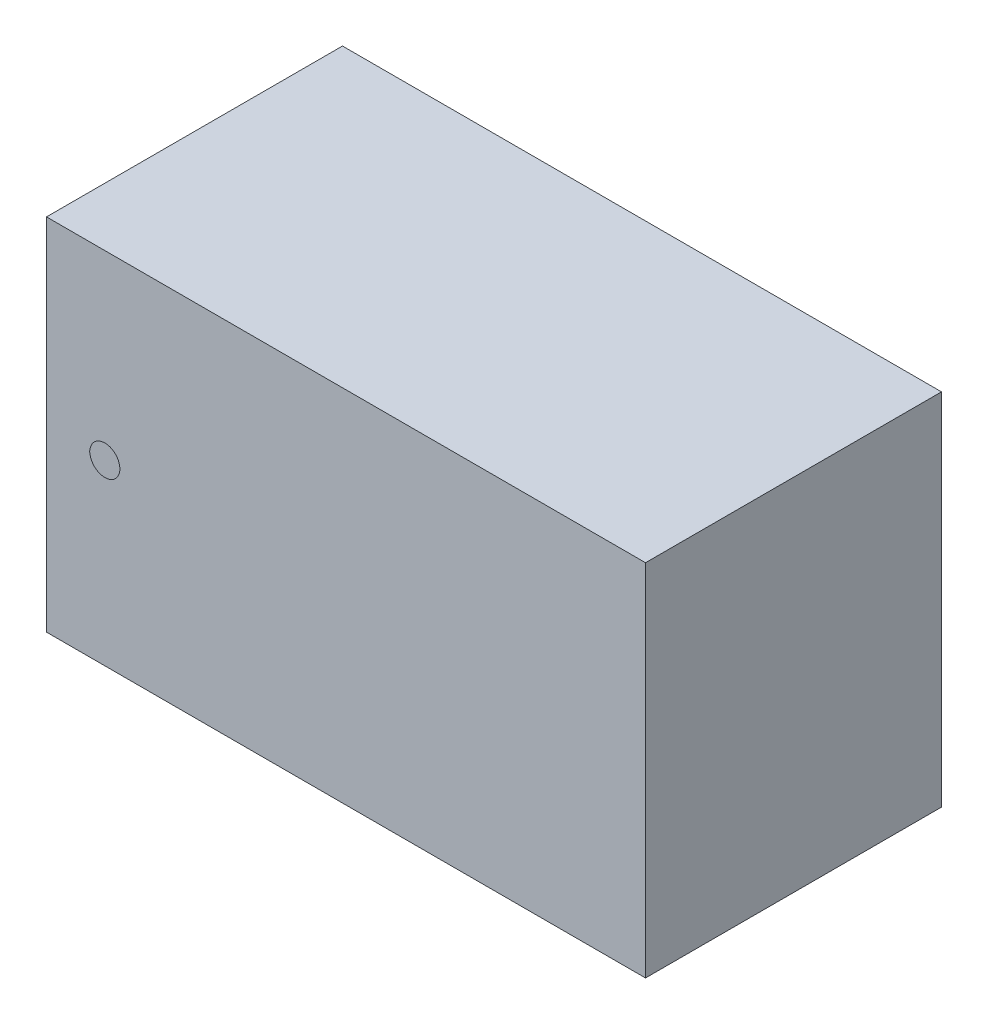
ISO-10303-21;
HEADER;
FILE_DESCRIPTION(('STEP AP214'),'2;1');
FILE_NAME('part.step','',(''),(''),'','','');
FILE_SCHEMA(('AUTOMOTIVE_DESIGN { 1 0 10303 214 1 1 1 1 }'));
ENDSEC;
DATA;
#1=APPLICATION_CONTEXT('core data for automotive mechanical design processes');
#2=APPLICATION_PROTOCOL_DEFINITION('international standard','automotive_design',2000,#1);
#3=PRODUCT_CONTEXT('',#1,'mechanical');
#4=PRODUCT('Part','Part','',(#3));
#5=PRODUCT_RELATED_PRODUCT_CATEGORY('part','',(#4));
#6=PRODUCT_DEFINITION_FORMATION('','',#4);
#7=PRODUCT_DEFINITION_CONTEXT('part definition',#1,'design');
#8=PRODUCT_DEFINITION('design','',#6,#7);
#9=PRODUCT_DEFINITION_SHAPE('','',#8);
#10=(LENGTH_UNIT() NAMED_UNIT(*) SI_UNIT(.MILLI.,.METRE.));
#11=(NAMED_UNIT(*) PLANE_ANGLE_UNIT() SI_UNIT($,.RADIAN.));
#12=(NAMED_UNIT(*) SI_UNIT($,.STERADIAN.) SOLID_ANGLE_UNIT());
#13=UNCERTAINTY_MEASURE_WITH_UNIT(LENGTH_MEASURE(1.E-05),#10,'distance_accuracy_value','');
#14=(GEOMETRIC_REPRESENTATION_CONTEXT(3) GLOBAL_UNCERTAINTY_ASSIGNED_CONTEXT((#13)) GLOBAL_UNIT_ASSIGNED_CONTEXT((#10,
#11,#12)) REPRESENTATION_CONTEXT('',''));
#15=CARTESIAN_POINT('',(0.,0.,0.));
#16=DIRECTION('',(0.,0.,1.));
#17=DIRECTION('',(1.,0.,0.));
#18=AXIS2_PLACEMENT_3D('',#15,#16,#17);
#19=CARTESIAN_POINT('',(-0.406,0.,0.508));
#20=DIRECTION('',(0.,0.,1.));
#21=DIRECTION('',(0.,1.,0.));
#22=AXIS2_PLACEMENT_3D('',#19,#20,#21);
#23=PLANE('',#22);
#24=CARTESIAN_POINT('',(-0.406,0.,0.508));
#25=DIRECTION('',(0.,0.,-1.));
#26=DIRECTION('',(1.,0.,0.));
#27=AXIS2_PLACEMENT_3D('',#24,#25,#26);
#28=CIRCLE('',#27,0.0254);
#29=CARTESIAN_POINT('',(-0.432,0.,0.511));
#30=VERTEX_POINT('',#29);
#31=CARTESIAN_POINT('',(-0.3806,0.,0.508));
#32=VERTEX_POINT('',#31);
#33=EDGE_CURVE('P0_E11',#30,#32,#28,.T.);
#34=ORIENTED_EDGE('',*,*,#33,.T.);
#35=CARTESIAN_POINT('',(-0.406,0.,0.508));
#36=DIRECTION('',(0.,0.,-1.));
#37=DIRECTION('',(1.,0.,0.));
#38=AXIS2_PLACEMENT_3D('',#35,#36,#37);
#39=CIRCLE('',#38,0.0254);
#40=EDGE_CURVE('P0_E22',#32,#30,#39,.T.);
#41=ORIENTED_EDGE('',*,*,#40,.T.);
#42=EDGE_LOOP('',(#34,#41));
#43=FACE_BOUND('',#42,.T.);
#44=ADVANCED_FACE('P0_F17',(#43),#23,.F.);
#45=OPEN_SHELL('',(#44));
#46=SHELL_BASED_SURFACE_MODEL('P0_B1',(#45));
#47=CARTESIAN_POINT('',(-0.406,0.,0.511));
#48=DIRECTION('',(0.,0.,1.));
#49=DIRECTION('',(0.,1.,0.));
#50=AXIS2_PLACEMENT_3D('',#47,#48,#49);
#51=PLANE('',#50);
#52=CARTESIAN_POINT('',(-0.406,0.,0.511));
#53=DIRECTION('',(0.,0.,1.));
#54=DIRECTION('',(1.,0.,0.));
#55=AXIS2_PLACEMENT_3D('',#52,#53,#54);
#56=CIRCLE('',#55,0.0254);
#57=CARTESIAN_POINT('',(-0.432,0.,0.511));
#58=VERTEX_POINT('',#57);
#59=CARTESIAN_POINT('',(-0.3806,0.,0.511));
#60=VERTEX_POINT('',#59);
#61=EDGE_CURVE('P1_E11',#58,#60,#56,.T.);
#62=ORIENTED_EDGE('',*,*,#61,.T.);
#63=CARTESIAN_POINT('',(-0.406,0.,0.511));
#64=DIRECTION('',(0.,0.,1.));
#65=DIRECTION('',(1.,0.,0.));
#66=AXIS2_PLACEMENT_3D('',#63,#64,#65);
#67=CIRCLE('',#66,0.0254);
#68=EDGE_CURVE('P1_E22',#60,#58,#67,.T.);
#69=ORIENTED_EDGE('',*,*,#68,.T.);
#70=EDGE_LOOP('',(#62,#69));
#71=FACE_BOUND('',#70,.T.);
#72=ADVANCED_FACE('P1_F17',(#71),#51,.T.);
#73=OPEN_SHELL('',(#72));
#74=SHELL_BASED_SURFACE_MODEL('P1_B1',(#73));
#75=CARTESIAN_POINT('',(-0.508,-0.305,0.006));
#76=DIRECTION('',(0.,-1.,0.));
#77=DIRECTION('',(0.,0.,1.));
#78=AXIS2_PLACEMENT_3D('',#75,#76,#77);
#79=PLANE('',#78);
#80=DIRECTION('',(-1.,0.,0.));
#81=VECTOR('',#80,1.);
#82=CARTESIAN_POINT('',(0.508,-0.305,0.006));
#83=LINE('',#82,#81);
#84=CARTESIAN_POINT('',(0.508,-0.305,0.006));
#85=VERTEX_POINT('',#84);
#86=CARTESIAN_POINT('',(-0.508,-0.305,0.006));
#87=VERTEX_POINT('',#86);
#88=EDGE_CURVE('P2_E11',#85,#87,#83,.T.);
#89=ORIENTED_EDGE('',*,*,#88,.F.);
#90=DIRECTION('',(0.,0.,-1.));
#91=VECTOR('',#90,1.);
#92=CARTESIAN_POINT('',(0.508,-0.305,0.508));
#93=LINE('',#92,#91);
#94=CARTESIAN_POINT('',(0.508,-0.305,0.508));
#95=VERTEX_POINT('',#94);
#96=EDGE_CURVE('P2_E25',#95,#85,#93,.T.);
#97=ORIENTED_EDGE('',*,*,#96,.F.);
#98=DIRECTION('',(1.,0.,0.));
#99=VECTOR('',#98,1.);
#100=CARTESIAN_POINT('',(-0.508,-0.305,0.508));
#101=LINE('',#100,#99);
#102=CARTESIAN_POINT('',(-0.508,-0.305,0.508));
#103=VERTEX_POINT('',#102);
#104=EDGE_CURVE('P2_E96',#103,#95,#101,.T.);
#105=ORIENTED_EDGE('',*,*,#104,.F.);
#106=DIRECTION('',(0.,0.,1.));
#107=VECTOR('',#106,1.);
#108=CARTESIAN_POINT('',(-0.508,-0.305,0.006));
#109=LINE('',#108,#107);
#110=EDGE_CURVE('P2_E91',#87,#103,#109,.T.);
#111=ORIENTED_EDGE('',*,*,#110,.F.);
#112=EDGE_LOOP('',(#89,#97,#105,#111));
#113=FACE_BOUND('',#112,.T.);
#114=ADVANCED_FACE('P2_F17',(#113),#79,.T.);
#115=CARTESIAN_POINT('',(-0.508,0.305,0.006));
#116=DIRECTION('',(-1.,0.,0.));
#117=DIRECTION('',(0.,0.,1.));
#118=AXIS2_PLACEMENT_3D('',#115,#116,#117);
#119=PLANE('',#118);
#120=DIRECTION('',(0.,1.,0.));
#121=VECTOR('',#120,1.);
#122=CARTESIAN_POINT('',(-0.508,-0.305,0.006));
#123=LINE('',#122,#121);
#124=CARTESIAN_POINT('',(-0.508,0.305,0.006));
#125=VERTEX_POINT('',#124);
#126=EDGE_CURVE('P2_E73',#87,#125,#123,.T.);
#127=ORIENTED_EDGE('',*,*,#126,.F.);
#128=ORIENTED_EDGE('',*,*,#110,.T.);
#129=DIRECTION('',(0.,-1.,0.));
#130=VECTOR('',#129,1.);
#131=CARTESIAN_POINT('',(-0.508,0.305,0.508));
#132=LINE('',#131,#130);
#133=CARTESIAN_POINT('',(-0.508,0.305,0.508));
#134=VERTEX_POINT('',#133);
#135=EDGE_CURVE('P2_E76',#134,#103,#132,.T.);
#136=ORIENTED_EDGE('',*,*,#135,.F.);
#137=DIRECTION('',(0.,0.,-1.));
#138=VECTOR('',#137,1.);
#139=CARTESIAN_POINT('',(-0.508,0.305,0.508));
#140=LINE('',#139,#138);
#141=EDGE_CURVE('P2_E74',#134,#125,#140,.T.);
#142=ORIENTED_EDGE('',*,*,#141,.T.);
#143=EDGE_LOOP('',(#127,#128,#136,#142));
#144=FACE_BOUND('',#143,.T.);
#145=ADVANCED_FACE('P2_F108',(#144),#119,.T.);
#146=CARTESIAN_POINT('',(0.508,0.305,0.006));
#147=DIRECTION('',(0.,1.,0.));
#148=DIRECTION('',(0.,0.,1.));
#149=AXIS2_PLACEMENT_3D('',#146,#147,#148);
#150=PLANE('',#149);
#151=DIRECTION('',(1.,0.,0.));
#152=VECTOR('',#151,1.);
#153=CARTESIAN_POINT('',(-0.508,0.305,0.006));
#154=LINE('',#153,#152);
#155=CARTESIAN_POINT('',(0.508,0.305,0.006));
#156=VERTEX_POINT('',#155);
#157=EDGE_CURVE('P2_E59',#125,#156,#154,.T.);
#158=ORIENTED_EDGE('',*,*,#157,.F.);
#159=ORIENTED_EDGE('',*,*,#141,.F.);
#160=DIRECTION('',(-1.,0.,0.));
#161=VECTOR('',#160,1.);
#162=CARTESIAN_POINT('',(0.508,0.305,0.508));
#163=LINE('',#162,#161);
#164=CARTESIAN_POINT('',(0.508,0.305,0.508));
#165=VERTEX_POINT('',#164);
#166=EDGE_CURVE('P2_E62',#165,#134,#163,.T.);
#167=ORIENTED_EDGE('',*,*,#166,.F.);
#168=DIRECTION('',(0.,0.,-1.));
#169=VECTOR('',#168,1.);
#170=CARTESIAN_POINT('',(0.508,0.305,0.508));
#171=LINE('',#170,#169);
#172=EDGE_CURVE('P2_E54',#165,#156,#171,.T.);
#173=ORIENTED_EDGE('',*,*,#172,.T.);
#174=EDGE_LOOP('',(#158,#159,#167,#173));
#175=FACE_BOUND('',#174,.T.);
#176=ADVANCED_FACE('P2_F56',(#175),#150,.T.);
#177=CARTESIAN_POINT('',(0.508,-0.305,0.006));
#178=DIRECTION('',(1.,0.,0.));
#179=DIRECTION('',(0.,0.,1.));
#180=AXIS2_PLACEMENT_3D('',#177,#178,#179);
#181=PLANE('',#180);
#182=DIRECTION('',(0.,-1.,0.));
#183=VECTOR('',#182,1.);
#184=CARTESIAN_POINT('',(0.508,0.305,0.006));
#185=LINE('',#184,#183);
#186=EDGE_CURVE('P2_E65',#156,#85,#185,.T.);
#187=ORIENTED_EDGE('',*,*,#186,.F.);
#188=ORIENTED_EDGE('',*,*,#172,.F.);
#189=DIRECTION('',(0.,1.,0.));
#190=VECTOR('',#189,1.);
#191=CARTESIAN_POINT('',(0.508,-0.305,0.508));
#192=LINE('',#191,#190);
#193=EDGE_CURVE('P2_E69',#95,#165,#192,.T.);
#194=ORIENTED_EDGE('',*,*,#193,.F.);
#195=ORIENTED_EDGE('',*,*,#96,.T.);
#196=EDGE_LOOP('',(#187,#188,#194,#195));
#197=FACE_BOUND('',#196,.T.);
#198=ADVANCED_FACE('P2_F67',(#197),#181,.T.);
#199=CARTESIAN_POINT('',(-0.508,-0.305,0.508));
#200=DIRECTION('',(0.,0.,1.));
#201=DIRECTION('',(0.,1.,0.));
#202=AXIS2_PLACEMENT_3D('',#199,#200,#201);
#203=PLANE('',#202);
#204=ORIENTED_EDGE('',*,*,#104,.T.);
#205=ORIENTED_EDGE('',*,*,#193,.T.);
#206=ORIENTED_EDGE('',*,*,#166,.T.);
#207=ORIENTED_EDGE('',*,*,#135,.T.);
#208=EDGE_LOOP('',(#204,#205,#206,#207));
#209=FACE_BOUND('',#208,.T.);
#210=ADVANCED_FACE('P2_F106',(#209),#203,.T.);
#211=CARTESIAN_POINT('',(-0.508,0.305,0.006));
#212=DIRECTION('',(0.,0.,-1.));
#213=DIRECTION('',(0.,1.,0.));
#214=AXIS2_PLACEMENT_3D('',#211,#212,#213);
#215=PLANE('',#214);
#216=ORIENTED_EDGE('',*,*,#157,.T.);
#217=ORIENTED_EDGE('',*,*,#186,.T.);
#218=ORIENTED_EDGE('',*,*,#88,.T.);
#219=ORIENTED_EDGE('',*,*,#126,.T.);
#220=EDGE_LOOP('',(#216,#217,#218,#219));
#221=FACE_BOUND('',#220,.T.);
#222=ADVANCED_FACE('P2_F71',(#221),#215,.T.);
#223=CLOSED_SHELL('',(#114,#145,#176,#198,#210,#222));
#224=MANIFOLD_SOLID_BREP('P2_B1',#223);
#225=CARTESIAN_POINT('',(0.165,-0.279,0.));
#226=DIRECTION('',(0.,-1.,0.));
#227=DIRECTION('',(0.,0.,1.));
#228=AXIS2_PLACEMENT_3D('',#225,#226,#227);
#229=PLANE('',#228);
#230=DIRECTION('',(-1.,0.,0.));
#231=VECTOR('',#230,1.);
#232=CARTESIAN_POINT('',(0.47,-0.279,0.));
#233=LINE('',#232,#231);
#234=CARTESIAN_POINT('',(0.47,-0.279,0.));
#235=VERTEX_POINT('',#234);
#236=CARTESIAN_POINT('',(0.165,-0.279,0.));
#237=VERTEX_POINT('',#236);
#238=EDGE_CURVE('P3_E11',#235,#237,#233,.T.);
#239=ORIENTED_EDGE('',*,*,#238,.F.);
#240=DIRECTION('',(0.,0.,-1.));
#241=VECTOR('',#240,1.);
#242=CARTESIAN_POINT('',(0.47,-0.279,0.006));
#243=LINE('',#242,#241);
#244=CARTESIAN_POINT('',(0.47,-0.279,0.006));
#245=VERTEX_POINT('',#244);
#246=EDGE_CURVE('P3_E25',#245,#235,#243,.T.);
#247=ORIENTED_EDGE('',*,*,#246,.F.);
#248=DIRECTION('',(1.,0.,0.));
#249=VECTOR('',#248,1.);
#250=CARTESIAN_POINT('',(0.165,-0.279,0.006));
#251=LINE('',#250,#249);
#252=CARTESIAN_POINT('',(0.165,-0.279,0.006));
#253=VERTEX_POINT('',#252);
#254=EDGE_CURVE('P3_E96',#253,#245,#251,.T.);
#255=ORIENTED_EDGE('',*,*,#254,.F.);
#256=DIRECTION('',(0.,0.,1.));
#257=VECTOR('',#256,1.);
#258=CARTESIAN_POINT('',(0.165,-0.279,0.));
#259=LINE('',#258,#257);
#260=EDGE_CURVE('P3_E91',#237,#253,#259,.T.);
#261=ORIENTED_EDGE('',*,*,#260,.F.);
#262=EDGE_LOOP('',(#239,#247,#255,#261));
#263=FACE_BOUND('',#262,.T.);
#264=ADVANCED_FACE('P3_F17',(#263),#229,.T.);
#265=CARTESIAN_POINT('',(0.165,0.279,0.));
#266=DIRECTION('',(-1.,0.,0.));
#267=DIRECTION('',(0.,0.,1.));
#268=AXIS2_PLACEMENT_3D('',#265,#266,#267);
#269=PLANE('',#268);
#270=DIRECTION('',(0.,1.,0.));
#271=VECTOR('',#270,1.);
#272=CARTESIAN_POINT('',(0.165,-0.279,0.));
#273=LINE('',#272,#271);
#274=CARTESIAN_POINT('',(0.165,0.279,0.));
#275=VERTEX_POINT('',#274);
#276=EDGE_CURVE('P3_E73',#237,#275,#273,.T.);
#277=ORIENTED_EDGE('',*,*,#276,.F.);
#278=ORIENTED_EDGE('',*,*,#260,.T.);
#279=DIRECTION('',(0.,-1.,0.));
#280=VECTOR('',#279,1.);
#281=CARTESIAN_POINT('',(0.165,0.279,0.006));
#282=LINE('',#281,#280);
#283=CARTESIAN_POINT('',(0.165,0.279,0.006));
#284=VERTEX_POINT('',#283);
#285=EDGE_CURVE('P3_E76',#284,#253,#282,.T.);
#286=ORIENTED_EDGE('',*,*,#285,.F.);
#287=DIRECTION('',(0.,0.,-1.));
#288=VECTOR('',#287,1.);
#289=CARTESIAN_POINT('',(0.165,0.279,0.006));
#290=LINE('',#289,#288);
#291=EDGE_CURVE('P3_E74',#284,#275,#290,.T.);
#292=ORIENTED_EDGE('',*,*,#291,.T.);
#293=EDGE_LOOP('',(#277,#278,#286,#292));
#294=FACE_BOUND('',#293,.T.);
#295=ADVANCED_FACE('P3_F108',(#294),#269,.T.);
#296=CARTESIAN_POINT('',(0.47,0.279,0.));
#297=DIRECTION('',(0.,1.,0.));
#298=DIRECTION('',(0.,0.,1.));
#299=AXIS2_PLACEMENT_3D('',#296,#297,#298);
#300=PLANE('',#299);
#301=DIRECTION('',(1.,0.,0.));
#302=VECTOR('',#301,1.);
#303=CARTESIAN_POINT('',(0.165,0.279,0.));
#304=LINE('',#303,#302);
#305=CARTESIAN_POINT('',(0.47,0.279,0.));
#306=VERTEX_POINT('',#305);
#307=EDGE_CURVE('P3_E59',#275,#306,#304,.T.);
#308=ORIENTED_EDGE('',*,*,#307,.F.);
#309=ORIENTED_EDGE('',*,*,#291,.F.);
#310=DIRECTION('',(-1.,0.,0.));
#311=VECTOR('',#310,1.);
#312=CARTESIAN_POINT('',(0.47,0.279,0.006));
#313=LINE('',#312,#311);
#314=CARTESIAN_POINT('',(0.47,0.279,0.006));
#315=VERTEX_POINT('',#314);
#316=EDGE_CURVE('P3_E62',#315,#284,#313,.T.);
#317=ORIENTED_EDGE('',*,*,#316,.F.);
#318=DIRECTION('',(0.,0.,-1.));
#319=VECTOR('',#318,1.);
#320=CARTESIAN_POINT('',(0.47,0.279,0.006));
#321=LINE('',#320,#319);
#322=EDGE_CURVE('P3_E54',#315,#306,#321,.T.);
#323=ORIENTED_EDGE('',*,*,#322,.T.);
#324=EDGE_LOOP('',(#308,#309,#317,#323));
#325=FACE_BOUND('',#324,.T.);
#326=ADVANCED_FACE('P3_F56',(#325),#300,.T.);
#327=CARTESIAN_POINT('',(0.47,-0.279,0.));
#328=DIRECTION('',(1.,0.,0.));
#329=DIRECTION('',(0.,0.,1.));
#330=AXIS2_PLACEMENT_3D('',#327,#328,#329);
#331=PLANE('',#330);
#332=DIRECTION('',(0.,-1.,0.));
#333=VECTOR('',#332,1.);
#334=CARTESIAN_POINT('',(0.47,0.279,0.));
#335=LINE('',#334,#333);
#336=EDGE_CURVE('P3_E65',#306,#235,#335,.T.);
#337=ORIENTED_EDGE('',*,*,#336,.F.);
#338=ORIENTED_EDGE('',*,*,#322,.F.);
#339=DIRECTION('',(0.,1.,0.));
#340=VECTOR('',#339,1.);
#341=CARTESIAN_POINT('',(0.47,-0.279,0.006));
#342=LINE('',#341,#340);
#343=EDGE_CURVE('P3_E69',#245,#315,#342,.T.);
#344=ORIENTED_EDGE('',*,*,#343,.F.);
#345=ORIENTED_EDGE('',*,*,#246,.T.);
#346=EDGE_LOOP('',(#337,#338,#344,#345));
#347=FACE_BOUND('',#346,.T.);
#348=ADVANCED_FACE('P3_F67',(#347),#331,.T.);
#349=CARTESIAN_POINT('',(0.165,-0.279,0.006));
#350=DIRECTION('',(0.,0.,1.));
#351=DIRECTION('',(0.,1.,0.));
#352=AXIS2_PLACEMENT_3D('',#349,#350,#351);
#353=PLANE('',#352);
#354=ORIENTED_EDGE('',*,*,#254,.T.);
#355=ORIENTED_EDGE('',*,*,#343,.T.);
#356=ORIENTED_EDGE('',*,*,#316,.T.);
#357=ORIENTED_EDGE('',*,*,#285,.T.);
#358=EDGE_LOOP('',(#354,#355,#356,#357));
#359=FACE_BOUND('',#358,.T.);
#360=ADVANCED_FACE('P3_F106',(#359),#353,.T.);
#361=CARTESIAN_POINT('',(0.165,0.279,0.));
#362=DIRECTION('',(0.,0.,-1.));
#363=DIRECTION('',(0.,1.,0.));
#364=AXIS2_PLACEMENT_3D('',#361,#362,#363);
#365=PLANE('',#364);
#366=ORIENTED_EDGE('',*,*,#307,.T.);
#367=ORIENTED_EDGE('',*,*,#336,.T.);
#368=ORIENTED_EDGE('',*,*,#238,.T.);
#369=ORIENTED_EDGE('',*,*,#276,.T.);
#370=EDGE_LOOP('',(#366,#367,#368,#369));
#371=FACE_BOUND('',#370,.T.);
#372=ADVANCED_FACE('P3_F71',(#371),#365,.T.);
#373=CLOSED_SHELL('',(#264,#295,#326,#348,#360,#372));
#374=MANIFOLD_SOLID_BREP('P3_B1',#373);
#375=CARTESIAN_POINT('',(-0.47,-0.279,0.));
#376=DIRECTION('',(0.,-1.,0.));
#377=DIRECTION('',(0.,0.,1.));
#378=AXIS2_PLACEMENT_3D('',#375,#376,#377);
#379=PLANE('',#378);
#380=DIRECTION('',(-1.,0.,0.));
#381=VECTOR('',#380,1.);
#382=CARTESIAN_POINT('',(-0.165,-0.279,0.));
#383=LINE('',#382,#381);
#384=CARTESIAN_POINT('',(-0.165,-0.279,0.));
#385=VERTEX_POINT('',#384);
#386=CARTESIAN_POINT('',(-0.47,-0.279,0.));
#387=VERTEX_POINT('',#386);
#388=EDGE_CURVE('P4_E11',#385,#387,#383,.T.);
#389=ORIENTED_EDGE('',*,*,#388,.F.);
#390=DIRECTION('',(0.,0.,-1.));
#391=VECTOR('',#390,1.);
#392=CARTESIAN_POINT('',(-0.165,-0.279,0.006));
#393=LINE('',#392,#391);
#394=CARTESIAN_POINT('',(-0.165,-0.279,0.006));
#395=VERTEX_POINT('',#394);
#396=EDGE_CURVE('P4_E25',#395,#385,#393,.T.);
#397=ORIENTED_EDGE('',*,*,#396,.F.);
#398=DIRECTION('',(1.,0.,0.));
#399=VECTOR('',#398,1.);
#400=CARTESIAN_POINT('',(-0.47,-0.279,0.006));
#401=LINE('',#400,#399);
#402=CARTESIAN_POINT('',(-0.47,-0.279,0.006));
#403=VERTEX_POINT('',#402);
#404=EDGE_CURVE('P4_E96',#403,#395,#401,.T.);
#405=ORIENTED_EDGE('',*,*,#404,.F.);
#406=DIRECTION('',(0.,0.,1.));
#407=VECTOR('',#406,1.);
#408=CARTESIAN_POINT('',(-0.47,-0.279,0.));
#409=LINE('',#408,#407);
#410=EDGE_CURVE('P4_E91',#387,#403,#409,.T.);
#411=ORIENTED_EDGE('',*,*,#410,.F.);
#412=EDGE_LOOP('',(#389,#397,#405,#411));
#413=FACE_BOUND('',#412,.T.);
#414=ADVANCED_FACE('P4_F17',(#413),#379,.T.);
#415=CARTESIAN_POINT('',(-0.47,0.279,0.));
#416=DIRECTION('',(-1.,0.,0.));
#417=DIRECTION('',(0.,0.,1.));
#418=AXIS2_PLACEMENT_3D('',#415,#416,#417);
#419=PLANE('',#418);
#420=DIRECTION('',(0.,1.,0.));
#421=VECTOR('',#420,1.);
#422=CARTESIAN_POINT('',(-0.47,-0.279,0.));
#423=LINE('',#422,#421);
#424=CARTESIAN_POINT('',(-0.47,0.279,0.));
#425=VERTEX_POINT('',#424);
#426=EDGE_CURVE('P4_E73',#387,#425,#423,.T.);
#427=ORIENTED_EDGE('',*,*,#426,.F.);
#428=ORIENTED_EDGE('',*,*,#410,.T.);
#429=DIRECTION('',(0.,-1.,0.));
#430=VECTOR('',#429,1.);
#431=CARTESIAN_POINT('',(-0.47,0.279,0.006));
#432=LINE('',#431,#430);
#433=CARTESIAN_POINT('',(-0.47,0.279,0.006));
#434=VERTEX_POINT('',#433);
#435=EDGE_CURVE('P4_E76',#434,#403,#432,.T.);
#436=ORIENTED_EDGE('',*,*,#435,.F.);
#437=DIRECTION('',(0.,0.,-1.));
#438=VECTOR('',#437,1.);
#439=CARTESIAN_POINT('',(-0.47,0.279,0.006));
#440=LINE('',#439,#438);
#441=EDGE_CURVE('P4_E74',#434,#425,#440,.T.);
#442=ORIENTED_EDGE('',*,*,#441,.T.);
#443=EDGE_LOOP('',(#427,#428,#436,#442));
#444=FACE_BOUND('',#443,.T.);
#445=ADVANCED_FACE('P4_F108',(#444),#419,.T.);
#446=CARTESIAN_POINT('',(-0.165,0.279,0.));
#447=DIRECTION('',(0.,1.,0.));
#448=DIRECTION('',(0.,0.,1.));
#449=AXIS2_PLACEMENT_3D('',#446,#447,#448);
#450=PLANE('',#449);
#451=DIRECTION('',(1.,0.,0.));
#452=VECTOR('',#451,1.);
#453=CARTESIAN_POINT('',(-0.47,0.279,0.));
#454=LINE('',#453,#452);
#455=CARTESIAN_POINT('',(-0.165,0.279,0.));
#456=VERTEX_POINT('',#455);
#457=EDGE_CURVE('P4_E59',#425,#456,#454,.T.);
#458=ORIENTED_EDGE('',*,*,#457,.F.);
#459=ORIENTED_EDGE('',*,*,#441,.F.);
#460=DIRECTION('',(-1.,0.,0.));
#461=VECTOR('',#460,1.);
#462=CARTESIAN_POINT('',(-0.165,0.279,0.006));
#463=LINE('',#462,#461);
#464=CARTESIAN_POINT('',(-0.165,0.279,0.006));
#465=VERTEX_POINT('',#464);
#466=EDGE_CURVE('P4_E62',#465,#434,#463,.T.);
#467=ORIENTED_EDGE('',*,*,#466,.F.);
#468=DIRECTION('',(0.,0.,-1.));
#469=VECTOR('',#468,1.);
#470=CARTESIAN_POINT('',(-0.165,0.279,0.006));
#471=LINE('',#470,#469);
#472=EDGE_CURVE('P4_E54',#465,#456,#471,.T.);
#473=ORIENTED_EDGE('',*,*,#472,.T.);
#474=EDGE_LOOP('',(#458,#459,#467,#473));
#475=FACE_BOUND('',#474,.T.);
#476=ADVANCED_FACE('P4_F56',(#475),#450,.T.);
#477=CARTESIAN_POINT('',(-0.165,-0.279,0.));
#478=DIRECTION('',(1.,0.,0.));
#479=DIRECTION('',(0.,0.,1.));
#480=AXIS2_PLACEMENT_3D('',#477,#478,#479);
#481=PLANE('',#480);
#482=DIRECTION('',(0.,-1.,0.));
#483=VECTOR('',#482,1.);
#484=CARTESIAN_POINT('',(-0.165,0.279,0.));
#485=LINE('',#484,#483);
#486=EDGE_CURVE('P4_E65',#456,#385,#485,.T.);
#487=ORIENTED_EDGE('',*,*,#486,.F.);
#488=ORIENTED_EDGE('',*,*,#472,.F.);
#489=DIRECTION('',(0.,1.,0.));
#490=VECTOR('',#489,1.);
#491=CARTESIAN_POINT('',(-0.165,-0.279,0.006));
#492=LINE('',#491,#490);
#493=EDGE_CURVE('P4_E69',#395,#465,#492,.T.);
#494=ORIENTED_EDGE('',*,*,#493,.F.);
#495=ORIENTED_EDGE('',*,*,#396,.T.);
#496=EDGE_LOOP('',(#487,#488,#494,#495));
#497=FACE_BOUND('',#496,.T.);
#498=ADVANCED_FACE('P4_F67',(#497),#481,.T.);
#499=CARTESIAN_POINT('',(-0.47,-0.279,0.006));
#500=DIRECTION('',(0.,0.,1.));
#501=DIRECTION('',(0.,1.,0.));
#502=AXIS2_PLACEMENT_3D('',#499,#500,#501);
#503=PLANE('',#502);
#504=ORIENTED_EDGE('',*,*,#404,.T.);
#505=ORIENTED_EDGE('',*,*,#493,.T.);
#506=ORIENTED_EDGE('',*,*,#466,.T.);
#507=ORIENTED_EDGE('',*,*,#435,.T.);
#508=EDGE_LOOP('',(#504,#505,#506,#507));
#509=FACE_BOUND('',#508,.T.);
#510=ADVANCED_FACE('P4_F106',(#509),#503,.T.);
#511=CARTESIAN_POINT('',(-0.47,0.279,0.));
#512=DIRECTION('',(0.,0.,-1.));
#513=DIRECTION('',(0.,1.,0.));
#514=AXIS2_PLACEMENT_3D('',#511,#512,#513);
#515=PLANE('',#514);
#516=ORIENTED_EDGE('',*,*,#457,.T.);
#517=ORIENTED_EDGE('',*,*,#486,.T.);
#518=ORIENTED_EDGE('',*,*,#388,.T.);
#519=ORIENTED_EDGE('',*,*,#426,.T.);
#520=EDGE_LOOP('',(#516,#517,#518,#519));
#521=FACE_BOUND('',#520,.T.);
#522=ADVANCED_FACE('P4_F71',(#521),#515,.T.);
#523=CLOSED_SHELL('',(#414,#445,#476,#498,#510,#522));
#524=MANIFOLD_SOLID_BREP('P4_B1',#523);
#525=ADVANCED_BREP_SHAPE_REPRESENTATION('',(#18,#224,#374,#524),#14);
#526=MANIFOLD_SURFACE_SHAPE_REPRESENTATION('',(#18,#46,#74),#14);
#527=SHAPE_REPRESENTATION('',(#18),#14);
#528=SHAPE_DEFINITION_REPRESENTATION(#9,#527);
#529=SHAPE_REPRESENTATION_RELATIONSHIP('','',#527,#525);
#530=SHAPE_REPRESENTATION_RELATIONSHIP('','',#527,#526);
ENDSEC;
END-ISO-10303-21;
